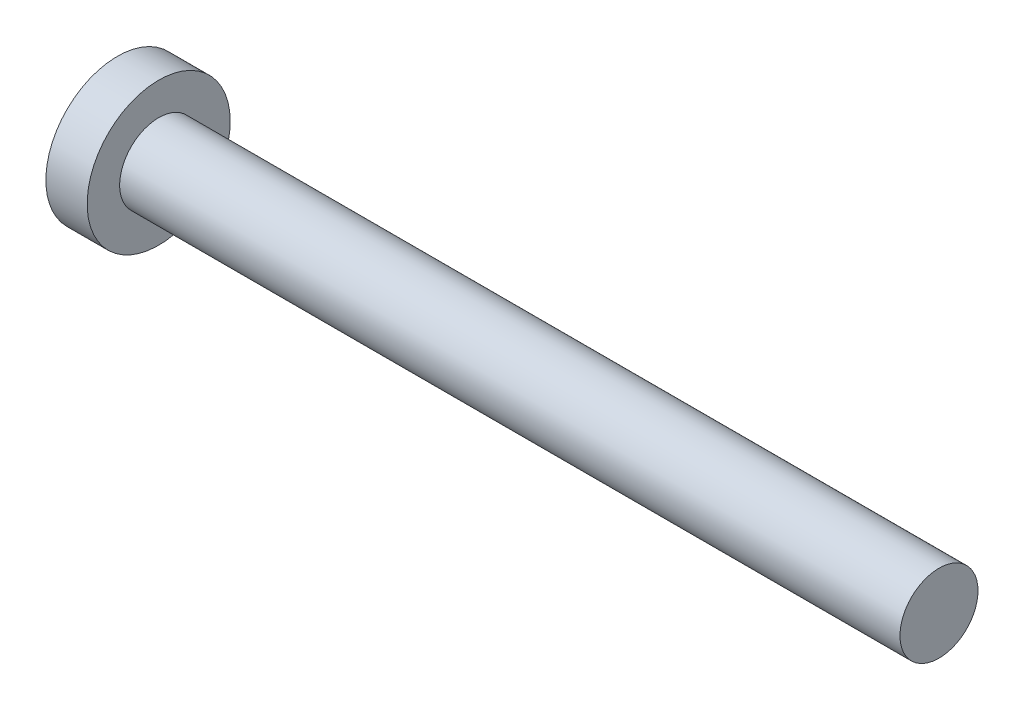
ISO-10303-21;
HEADER;
FILE_DESCRIPTION(('STEP AP214'),'2;1');
FILE_NAME('part.step','',(''),(''),'','','');
FILE_SCHEMA(('AUTOMOTIVE_DESIGN { 1 0 10303 214 1 1 1 1 }'));
ENDSEC;
DATA;
#1=APPLICATION_CONTEXT('core data for automotive mechanical design processes');
#2=APPLICATION_PROTOCOL_DEFINITION('international standard','automotive_design',2000,#1);
#3=PRODUCT_CONTEXT('',#1,'mechanical');
#4=PRODUCT('Part','Part','',(#3));
#5=PRODUCT_RELATED_PRODUCT_CATEGORY('part','',(#4));
#6=PRODUCT_DEFINITION_FORMATION('','',#4);
#7=PRODUCT_DEFINITION_CONTEXT('part definition',#1,'design');
#8=PRODUCT_DEFINITION('design','',#6,#7);
#9=PRODUCT_DEFINITION_SHAPE('','',#8);
#10=(LENGTH_UNIT() NAMED_UNIT(*) SI_UNIT(.MILLI.,.METRE.));
#11=(NAMED_UNIT(*) PLANE_ANGLE_UNIT() SI_UNIT($,.RADIAN.));
#12=(NAMED_UNIT(*) SI_UNIT($,.STERADIAN.) SOLID_ANGLE_UNIT());
#13=UNCERTAINTY_MEASURE_WITH_UNIT(LENGTH_MEASURE(1.E-05),#10,'distance_accuracy_value','');
#14=(GEOMETRIC_REPRESENTATION_CONTEXT(3) GLOBAL_UNCERTAINTY_ASSIGNED_CONTEXT((#13)) GLOBAL_UNIT_ASSIGNED_CONTEXT((#10,
#11,#12)) REPRESENTATION_CONTEXT('',''));
#15=CARTESIAN_POINT('',(0.,0.,0.));
#16=DIRECTION('',(0.,0.,1.));
#17=DIRECTION('',(1.,0.,0.));
#18=AXIS2_PLACEMENT_3D('',#15,#16,#17);
#19=CARTESIAN_POINT('',(7.,0.,0.));
#20=DIRECTION('',(1.,0.,0.));
#21=DIRECTION('',(0.,1.,0.));
#22=AXIS2_PLACEMENT_3D('',#19,#20,#21);
#23=SPHERICAL_SURFACE('',#22,7.);
#24=CARTESIAN_POINT('',(0.562803405208133,0.,0.));
#25=DIRECTION('',(1.,0.,0.));
#26=DIRECTION('',(0.,0.,-1.));
#27=AXIS2_PLACEMENT_3D('',#24,#25,#26);
#28=CIRCLE('',#27,2.75);
#29=CARTESIAN_POINT('',(0.562803405208133,0.,-2.75));
#30=VERTEX_POINT('',#29);
#31=EDGE_CURVE('E145',#30,#30,#28,.T.);
#32=ORIENTED_EDGE('',*,*,#31,.F.);
#33=EDGE_LOOP('',(#32));
#34=FACE_BOUND('',#33,.T.);
#35=CARTESIAN_POINT('',(7.,-0.35,0.));
#36=DIRECTION('',(0.,1.,0.));
#37=DIRECTION('',(0.,0.,1.));
#38=AXIS2_PLACEMENT_3D('',#35,#36,#37);
#39=CIRCLE('',#38,6.99124452440336);
#40=CARTESIAN_POINT('',(0.202207901971563,-0.35,1.63325521336445));
#41=VERTEX_POINT('',#40);
#42=CARTESIAN_POINT('',(0.0390374228846765,-0.35,0.65));
#43=VERTEX_POINT('',#42);
#44=EDGE_CURVE('E229',#41,#43,#39,.F.);
#45=ORIENTED_EDGE('',*,*,#44,.T.);
#46=CARTESIAN_POINT('',(0.0390374228846756,-0.35,0.65));
#47=CARTESIAN_POINT('',(0.0374700694243655,-0.349985440486237,0.633229435492668));
#48=CARTESIAN_POINT('',(0.0360362290844049,-0.351405486422546,0.616448534995232));
#49=CARTESIAN_POINT('',(0.0334709445420207,-0.357021752659004,0.583343325597952));
#50=CARTESIAN_POINT('',(0.0323393353853684,-0.361216454220262,0.567018772003475));
#51=CARTESIAN_POINT('',(0.0304114469291461,-0.372292892009714,0.535273514121183));
#52=CARTESIAN_POINT('',(0.0296153929596675,-0.379176427871001,0.519853423155776));
#53=CARTESIAN_POINT('',(0.0283828822273591,-0.395434490325505,0.490377163633401));
#54=CARTESIAN_POINT('',(0.027946329469038,-0.40480835105713,0.476320631858257));
#55=CARTESIAN_POINT('',(0.0274467131921521,-0.425734016368014,0.450035772000472));
#56=CARTESIAN_POINT('',(0.0273819024144786,-0.437275368321188,0.437799154967676));
#57=CARTESIAN_POINT('',(0.0276230236990662,-0.462238269102188,0.415422741964805));
#58=CARTESIAN_POINT('',(0.0279290177996376,-0.475660132220693,0.405283297198959));
#59=CARTESIAN_POINT('',(0.0289017433452393,-0.503968429911908,0.387407977842754));
#60=CARTESIAN_POINT('',(0.0295677703554314,-0.518851958231585,0.379667455933492));
#61=CARTESIAN_POINT('',(0.0312408204264315,-0.549680912740726,0.366777697245176));
#62=CARTESIAN_POINT('',(0.0322476895633196,-0.565625856989349,0.361627293376779));
#63=CARTESIAN_POINT('',(0.0342092441635674,-0.593044486650942,0.355232268632674));
#64=CARTESIAN_POINT('',(0.035082331918513,-0.604362330799613,0.35327056524664));
#65=CARTESIAN_POINT('',(0.0369623529307515,-0.627120660183501,0.350654423460588));
#66=CARTESIAN_POINT('',(0.03796909322206,-0.63856094714645,0.34999812176879));
#67=CARTESIAN_POINT('',(0.0390374228846772,-0.65,0.35));
#68=B_SPLINE_CURVE_WITH_KNOTS('',3,(#46,#47,#48,#49,#50,#51,#52,#53,#54,#55,#56,#57,#58,#59,#60,
#61,#62,#63,#64,#65,#66,#67),.UNSPECIFIED.,.F.,.F.,(4,2,2,2,2,2,2,2,2,2,4),(0.,
0.0504676812079533,0.100907761197792,0.151381658668403,0.201842074017182,0.252065120075446,
0.302296569969034,0.352430091647058,0.40254100321972,0.437028940734074,0.471467615758251),.UNSPECIFIED.);
#69=CARTESIAN_POINT('',(0.0390374228846765,-0.65,0.35));
#70=VERTEX_POINT('',#69);
#71=EDGE_CURVE('E232',#43,#70,#68,.T.);
#72=ORIENTED_EDGE('',*,*,#71,.T.);
#73=CARTESIAN_POINT('',(7.,0.,0.35));
#74=DIRECTION('',(0.,0.,-1.));
#75=DIRECTION('',(0.,1.,0.));
#76=AXIS2_PLACEMENT_3D('',#73,#74,#75);
#77=CIRCLE('',#76,6.99124452440336);
#78=CARTESIAN_POINT('',(0.202207901971563,-1.63325521336445,0.35));
#79=VERTEX_POINT('',#78);
#80=EDGE_CURVE('E241',#70,#79,#77,.F.);
#81=ORIENTED_EDGE('',*,*,#80,.T.);
#82=CARTESIAN_POINT('',(6.00777222831138,1.71858891324554,0.));
#83=DIRECTION('',(-0.500000000000001,0.866025403784438,0.));
#84=DIRECTION('',(-0.866025403784438,-0.500000000000001,0.));
#85=AXIS2_PLACEMENT_3D('',#82,#83,#84);
#86=CIRCLE('',#85,6.71281879662779);
#87=CARTESIAN_POINT('',(0.202207901971563,-1.63325521336445,-0.35));
#88=VERTEX_POINT('',#87);
#89=EDGE_CURVE('E244',#79,#88,#86,.F.);
#90=ORIENTED_EDGE('',*,*,#89,.T.);
#91=CARTESIAN_POINT('',(7.,0.,-0.35));
#92=DIRECTION('',(0.,0.,1.));
#93=DIRECTION('',(1.,0.,0.));
#94=AXIS2_PLACEMENT_3D('',#91,#92,#93);
#95=CIRCLE('',#94,6.99124452440336);
#96=CARTESIAN_POINT('',(0.0390374228846765,-0.65,-0.35));
#97=VERTEX_POINT('',#96);
#98=EDGE_CURVE('E250',#88,#97,#95,.F.);
#99=ORIENTED_EDGE('',*,*,#98,.T.);
#100=CARTESIAN_POINT('',(0.0390374228846756,-0.65,-0.35));
#101=CARTESIAN_POINT('',(0.0374700694243655,-0.633229435492668,-0.349985440486238));
#102=CARTESIAN_POINT('',(0.0360362290844049,-0.616448534995233,-0.351405486422546));
#103=CARTESIAN_POINT('',(0.0334709445420207,-0.583343325597952,-0.357021752659005));
#104=CARTESIAN_POINT('',(0.0323393353853684,-0.567018772003475,-0.361216454220263));
#105=CARTESIAN_POINT('',(0.0304114469291461,-0.535273514121184,-0.372292892009714));
#106=CARTESIAN_POINT('',(0.0296153929596675,-0.519853423155776,-0.379176427871001));
#107=CARTESIAN_POINT('',(0.0283828822273591,-0.490377163633401,-0.395434490325505));
#108=CARTESIAN_POINT('',(0.027946329469038,-0.476320631858257,-0.40480835105713));
#109=CARTESIAN_POINT('',(0.0274467131921521,-0.450035772000473,-0.425734016368015));
#110=CARTESIAN_POINT('',(0.0273819024144786,-0.437799154967677,-0.437275368321189));
#111=CARTESIAN_POINT('',(0.0276230236990662,-0.415422741964805,-0.462238269102188));
#112=CARTESIAN_POINT('',(0.0279290177996376,-0.405283297198959,-0.475660132220694));
#113=CARTESIAN_POINT('',(0.0289017433452393,-0.387407977842754,-0.503968429911908));
#114=CARTESIAN_POINT('',(0.0295677703554313,-0.379667455933492,-0.518851958231585));
#115=CARTESIAN_POINT('',(0.0312408204264315,-0.366777697245176,-0.549680912740727));
#116=CARTESIAN_POINT('',(0.0322476895633196,-0.361627293376779,-0.565625856989349));
#117=CARTESIAN_POINT('',(0.0342092441635673,-0.355232268632674,-0.593044486650942));
#118=CARTESIAN_POINT('',(0.035082331918513,-0.35327056524664,-0.604362330799613));
#119=CARTESIAN_POINT('',(0.0369623529307514,-0.350654423460588,-0.627120660183501));
#120=CARTESIAN_POINT('',(0.0379690932220599,-0.349998121768791,-0.63856094714645));
#121=CARTESIAN_POINT('',(0.0390374228846772,-0.35,-0.65));
#122=B_SPLINE_CURVE_WITH_KNOTS('',3,(#100,#101,#102,#103,#104,#105,#106,#107,#108,#109,#110,
#111,#112,#113,#114,#115,#116,#117,#118,#119,#120,#121),.UNSPECIFIED.,.F.,.F.,(4,2,2,2,2,2,2,2,
2,2,4),(0.,0.0504676812079532,0.100907761197792,0.151381658668403,0.201842074017182,
0.252065120075446,0.302296569969034,0.352430091647058,0.40254100321972,0.437028940734074,
0.471467615758251),.UNSPECIFIED.);
#123=CARTESIAN_POINT('',(0.0390374228846765,-0.35,-0.65));
#124=VERTEX_POINT('',#123);
#125=EDGE_CURVE('E351',#97,#124,#122,.T.);
#126=ORIENTED_EDGE('',*,*,#125,.T.);
#127=CARTESIAN_POINT('',(7.,-0.35,0.));
#128=DIRECTION('',(0.,1.,0.));
#129=DIRECTION('',(0.,0.,1.));
#130=AXIS2_PLACEMENT_3D('',#127,#128,#129);
#131=CIRCLE('',#130,6.99124452440336);
#132=CARTESIAN_POINT('',(0.202207901971563,-0.35,-1.63325521336445));
#133=VERTEX_POINT('',#132);
#134=EDGE_CURVE('E248',#124,#133,#131,.F.);
#135=ORIENTED_EDGE('',*,*,#134,.T.);
#136=CARTESIAN_POINT('',(6.00777222831138,0.,1.71858891324554));
#137=DIRECTION('',(-0.500000000000001,0.,0.866025403784438));
#138=DIRECTION('',(0.866025403784438,0.,0.500000000000001));
#139=AXIS2_PLACEMENT_3D('',#136,#137,#138);
#140=CIRCLE('',#139,6.71281879662779);
#141=CARTESIAN_POINT('',(0.202207901971563,0.35,-1.63325521336445));
#142=VERTEX_POINT('',#141);
#143=EDGE_CURVE('E251',#133,#142,#140,.F.);
#144=ORIENTED_EDGE('',*,*,#143,.T.);
#145=CARTESIAN_POINT('',(7.,0.35,0.));
#146=DIRECTION('',(0.,-1.,0.));
#147=DIRECTION('',(0.,0.,-1.));
#148=AXIS2_PLACEMENT_3D('',#145,#146,#147);
#149=CIRCLE('',#148,6.99124452440336);
#150=CARTESIAN_POINT('',(0.0390374228846765,0.35,-0.65));
#151=VERTEX_POINT('',#150);
#152=EDGE_CURVE('E252',#142,#151,#149,.F.);
#153=ORIENTED_EDGE('',*,*,#152,.T.);
#154=CARTESIAN_POINT('',(0.0390374228846756,0.35,-0.65));
#155=CARTESIAN_POINT('',(0.0374700694243655,0.349985440486237,-0.633229435492668));
#156=CARTESIAN_POINT('',(0.0360362290844049,0.351405486422546,-0.616448534995233));
#157=CARTESIAN_POINT('',(0.0334709445420207,0.357021752659004,-0.583343325597952));
#158=CARTESIAN_POINT('',(0.0323393353853684,0.361216454220262,-0.567018772003475));
#159=CARTESIAN_POINT('',(0.0304114469291461,0.372292892009714,-0.535273514121184));
#160=CARTESIAN_POINT('',(0.0296153929596675,0.379176427871001,-0.519853423155777));
#161=CARTESIAN_POINT('',(0.0283828822273591,0.395434490325504,-0.490377163633401));
#162=CARTESIAN_POINT('',(0.027946329469038,0.40480835105713,-0.476320631858257));
#163=CARTESIAN_POINT('',(0.0274467131921521,0.425734016368014,-0.450035772000473));
#164=CARTESIAN_POINT('',(0.0273819024144786,0.437275368321188,-0.437799154967677));
#165=CARTESIAN_POINT('',(0.0276230236990661,0.462238269102188,-0.415422741964805));
#166=CARTESIAN_POINT('',(0.0279290177996375,0.475660132220693,-0.40528329719896));
#167=CARTESIAN_POINT('',(0.0289017433452393,0.503968429911908,-0.387407977842754));
#168=CARTESIAN_POINT('',(0.0295677703554313,0.518851958231585,-0.379667455933492));
#169=CARTESIAN_POINT('',(0.0312408204264315,0.549680912740726,-0.366777697245177));
#170=CARTESIAN_POINT('',(0.0322476895633195,0.565625856989348,-0.36162729337678));
#171=CARTESIAN_POINT('',(0.0342092441635673,0.593044486650942,-0.355232268632674));
#172=CARTESIAN_POINT('',(0.0350823319185129,0.604362330799613,-0.35327056524664));
#173=CARTESIAN_POINT('',(0.0369623529307514,0.627120660183501,-0.350654423460588));
#174=CARTESIAN_POINT('',(0.0379690932220599,0.63856094714645,-0.349998121768791));
#175=CARTESIAN_POINT('',(0.0390374228846772,0.65,-0.35));
#176=B_SPLINE_CURVE_WITH_KNOTS('',3,(#154,#155,#156,#157,#158,#159,#160,#161,#162,#163,#164,
#165,#166,#167,#168,#169,#170,#171,#172,#173,#174,#175),.UNSPECIFIED.,.F.,.F.,(4,2,2,2,2,2,2,2,
2,2,4),(0.,0.0504676812079534,0.100907761197792,0.151381658668403,0.201842074017182,
0.252065120075445,0.302296569969033,0.352430091647057,0.40254100321972,0.437028940734074,
0.471467615758251),.UNSPECIFIED.);
#177=CARTESIAN_POINT('',(0.0390374228846765,0.65,-0.35));
#178=VERTEX_POINT('',#177);
#179=EDGE_CURVE('E163',#151,#178,#176,.T.);
#180=ORIENTED_EDGE('',*,*,#179,.T.);
#181=CARTESIAN_POINT('',(7.,0.,-0.35));
#182=DIRECTION('',(0.,0.,1.));
#183=DIRECTION('',(1.,0.,0.));
#184=AXIS2_PLACEMENT_3D('',#181,#182,#183);
#185=CIRCLE('',#184,6.99124452440336);
#186=CARTESIAN_POINT('',(0.202207901971563,1.63325521336445,-0.35));
#187=VERTEX_POINT('',#186);
#188=EDGE_CURVE('E254',#178,#187,#185,.F.);
#189=ORIENTED_EDGE('',*,*,#188,.T.);
#190=CARTESIAN_POINT('',(6.00777222831138,-1.71858891324554,0.));
#191=DIRECTION('',(-0.500000000000001,-0.866025403784438,0.));
#192=DIRECTION('',(0.866025403784438,-0.500000000000001,0.));
#193=AXIS2_PLACEMENT_3D('',#190,#191,#192);
#194=CIRCLE('',#193,6.71281879662779);
#195=CARTESIAN_POINT('',(0.202207901971563,1.63325521336445,0.35));
#196=VERTEX_POINT('',#195);
#197=EDGE_CURVE('E128',#187,#196,#194,.F.);
#198=ORIENTED_EDGE('',*,*,#197,.T.);
#199=CARTESIAN_POINT('',(7.,0.,0.35));
#200=DIRECTION('',(0.,0.,-1.));
#201=DIRECTION('',(0.,1.,0.));
#202=AXIS2_PLACEMENT_3D('',#199,#200,#201);
#203=CIRCLE('',#202,6.99124452440336);
#204=CARTESIAN_POINT('',(0.0390374228846765,0.65,0.35));
#205=VERTEX_POINT('',#204);
#206=EDGE_CURVE('E159',#196,#205,#203,.F.);
#207=ORIENTED_EDGE('',*,*,#206,.T.);
#208=CARTESIAN_POINT('',(0.0390374228846756,0.65,0.35));
#209=CARTESIAN_POINT('',(0.0374700694243655,0.633229435492668,0.349985440486237));
#210=CARTESIAN_POINT('',(0.0360362290844049,0.616448534995232,0.351405486422546));
#211=CARTESIAN_POINT('',(0.0334709445420207,0.583343325597952,0.357021752659004));
#212=CARTESIAN_POINT('',(0.0323393353853684,0.567018772003475,0.361216454220262));
#213=CARTESIAN_POINT('',(0.0304114469291461,0.535273514121184,0.372292892009714));
#214=CARTESIAN_POINT('',(0.0296153929596675,0.519853423155777,0.379176427871001));
#215=CARTESIAN_POINT('',(0.0283828822273591,0.490377163633401,0.395434490325504));
#216=CARTESIAN_POINT('',(0.027946329469038,0.476320631858257,0.40480835105713));
#217=CARTESIAN_POINT('',(0.0274467131921521,0.450035772000473,0.425734016368014));
#218=CARTESIAN_POINT('',(0.0273819024144786,0.437799154967677,0.437275368321188));
#219=CARTESIAN_POINT('',(0.0276230236990662,0.415422741964805,0.462238269102188));
#220=CARTESIAN_POINT('',(0.0279290177996376,0.405283297198959,0.475660132220693));
#221=CARTESIAN_POINT('',(0.0289017433452393,0.387407977842754,0.503968429911908));
#222=CARTESIAN_POINT('',(0.0295677703554313,0.379667455933492,0.518851958231585));
#223=CARTESIAN_POINT('',(0.0312408204264315,0.366777697245176,0.549680912740726));
#224=CARTESIAN_POINT('',(0.0322476895633196,0.361627293376779,0.565625856989349));
#225=CARTESIAN_POINT('',(0.0342092441635674,0.355232268632674,0.593044486650942));
#226=CARTESIAN_POINT('',(0.035082331918513,0.35327056524664,0.604362330799613));
#227=CARTESIAN_POINT('',(0.0369623529307515,0.350654423460588,0.627120660183501));
#228=CARTESIAN_POINT('',(0.03796909322206,0.34999812176879,0.63856094714645));
#229=CARTESIAN_POINT('',(0.0390374228846772,0.35,0.65));
#230=B_SPLINE_CURVE_WITH_KNOTS('',3,(#208,#209,#210,#211,#212,#213,#214,#215,#216,#217,#218,
#219,#220,#221,#222,#223,#224,#225,#226,#227,#228,#229),.UNSPECIFIED.,.F.,.F.,(4,2,2,2,2,2,2,2,
2,2,4),(0.,0.0504676812079534,0.100907761197792,0.151381658668403,0.201842074017182,
0.252065120075446,0.302296569969034,0.352430091647058,0.40254100321972,0.437028940734074,
0.471467615758251),.UNSPECIFIED.);
#231=CARTESIAN_POINT('',(0.0390374228846765,0.35,0.65));
#232=VERTEX_POINT('',#231);
#233=EDGE_CURVE('E173',#205,#232,#230,.T.);
#234=ORIENTED_EDGE('',*,*,#233,.T.);
#235=CARTESIAN_POINT('',(7.,0.35,0.));
#236=DIRECTION('',(0.,-1.,0.));
#237=DIRECTION('',(0.,0.,-1.));
#238=AXIS2_PLACEMENT_3D('',#235,#236,#237);
#239=CIRCLE('',#238,6.99124452440336);
#240=CARTESIAN_POINT('',(0.202207901971563,0.35,1.63325521336445));
#241=VERTEX_POINT('',#240);
#242=EDGE_CURVE('E164',#232,#241,#239,.F.);
#243=ORIENTED_EDGE('',*,*,#242,.T.);
#244=CARTESIAN_POINT('',(6.00777222831138,0.,-1.71858891324554));
#245=DIRECTION('',(-0.500000000000001,0.,-0.866025403784438));
#246=DIRECTION('',(-0.866025403784438,0.,0.500000000000001));
#247=AXIS2_PLACEMENT_3D('',#244,#245,#246);
#248=CIRCLE('',#247,6.71281879662779);
#249=EDGE_CURVE('E235',#241,#41,#248,.F.);
#250=ORIENTED_EDGE('',*,*,#249,.T.);
#251=EDGE_LOOP('',(#45,#72,#81,#90,#99,#126,#135,#144,#153,#180,#189,#198,#207,#234,#243,#250));
#252=FACE_BOUND('',#251,.T.);
#253=ADVANCED_FACE('F43',(#34,#252),#23,.T.);
#254=CARTESIAN_POINT('',(32.15,1.5,0.));
#255=DIRECTION('',(1.,0.,0.));
#256=DIRECTION('',(0.,0.,-1.));
#257=AXIS2_PLACEMENT_3D('',#254,#255,#256);
#258=PLANE('',#257);
#259=CARTESIAN_POINT('',(32.15,0.,0.));
#260=DIRECTION('',(1.,0.,0.));
#261=DIRECTION('',(0.,0.,-1.));
#262=AXIS2_PLACEMENT_3D('',#259,#260,#261);
#263=CIRCLE('',#262,1.5);
#264=CARTESIAN_POINT('',(32.15,0.,-1.5));
#265=VERTEX_POINT('',#264);
#266=EDGE_CURVE('E156',#265,#265,#263,.T.);
#267=ORIENTED_EDGE('',*,*,#266,.T.);
#268=EDGE_LOOP('',(#267));
#269=FACE_BOUND('',#268,.T.);
#270=ADVANCED_FACE('F215',(#269),#258,.T.);
#271=CARTESIAN_POINT('',(4.51581291088132,0.,0.));
#272=DIRECTION('',(1.,0.,0.));
#273=DIRECTION('',(0.,0.,-1.));
#274=AXIS2_PLACEMENT_3D('',#271,#272,#273);
#275=CYLINDRICAL_SURFACE('',#274,1.5);
#276=CARTESIAN_POINT('',(2.15,0.,0.));
#277=DIRECTION('',(1.,0.,0.));
#278=DIRECTION('',(0.,0.,-1.));
#279=AXIS2_PLACEMENT_3D('',#276,#277,#278);
#280=CIRCLE('',#279,1.5);
#281=CARTESIAN_POINT('',(2.15,0.,-1.5));
#282=VERTEX_POINT('',#281);
#283=EDGE_CURVE('E153',#282,#282,#280,.T.);
#284=ORIENTED_EDGE('',*,*,#283,.T.);
#285=EDGE_LOOP('',(#284));
#286=FACE_BOUND('',#285,.T.);
#287=ORIENTED_EDGE('',*,*,#266,.F.);
#288=EDGE_LOOP('',(#287));
#289=FACE_BOUND('',#288,.T.);
#290=ADVANCED_FACE('F220',(#286,#289),#275,.T.);
#291=CARTESIAN_POINT('',(2.15,1.8,0.));
#292=DIRECTION('',(1.,0.,0.));
#293=DIRECTION('',(0.,0.,-1.));
#294=AXIS2_PLACEMENT_3D('',#291,#292,#293);
#295=PLANE('',#294);
#296=CARTESIAN_POINT('',(2.15,0.,0.));
#297=DIRECTION('',(1.,0.,0.));
#298=DIRECTION('',(0.,0.,-1.));
#299=AXIS2_PLACEMENT_3D('',#296,#297,#298);
#300=CIRCLE('',#299,2.75);
#301=CARTESIAN_POINT('',(2.15,0.,-2.75));
#302=VERTEX_POINT('',#301);
#303=EDGE_CURVE('E148',#302,#302,#300,.T.);
#304=ORIENTED_EDGE('',*,*,#303,.T.);
#305=EDGE_LOOP('',(#304));
#306=FACE_BOUND('',#305,.T.);
#307=ORIENTED_EDGE('',*,*,#283,.F.);
#308=EDGE_LOOP('',(#307));
#309=FACE_BOUND('',#308,.T.);
#310=ADVANCED_FACE('F419',(#306,#309),#295,.T.);
#311=CARTESIAN_POINT('',(4.51581291088132,0.,0.));
#312=DIRECTION('',(1.,0.,0.));
#313=DIRECTION('',(0.,0.,-1.));
#314=AXIS2_PLACEMENT_3D('',#311,#312,#313);
#315=CYLINDRICAL_SURFACE('',#314,2.75);
#316=ORIENTED_EDGE('',*,*,#31,.T.);
#317=EDGE_LOOP('',(#316));
#318=FACE_BOUND('',#317,.T.);
#319=ORIENTED_EDGE('',*,*,#303,.F.);
#320=EDGE_LOOP('',(#319));
#321=FACE_BOUND('',#320,.T.);
#322=ADVANCED_FACE('F415',(#318,#321),#315,.T.);
#323=CARTESIAN_POINT('',(1.43,0.35,0.35));
#324=DIRECTION('',(0.,-1.,0.));
#325=DIRECTION('',(0.,0.,-1.));
#326=AXIS2_PLACEMENT_3D('',#323,#324,#325);
#327=PLANE('',#326);
#328=ORIENTED_EDGE('',*,*,#242,.F.);
#329=DIRECTION('',(-1.,0.,0.));
#330=VECTOR('',#329,1.);
#331=CARTESIAN_POINT('',(1.43,0.35,0.65));
#332=LINE('',#331,#330);
#333=CARTESIAN_POINT('',(1.43,0.35,0.65));
#334=VERTEX_POINT('',#333);
#335=EDGE_CURVE('E305',#232,#334,#332,.F.);
#336=ORIENTED_EDGE('',*,*,#335,.T.);
#337=DIRECTION('',(0.,0.,1.));
#338=VECTOR('',#337,1.);
#339=CARTESIAN_POINT('',(1.43,0.35,0.35));
#340=LINE('',#339,#338);
#341=CARTESIAN_POINT('',(1.43,0.35,0.924389115058833));
#342=VERTEX_POINT('',#341);
#343=EDGE_CURVE('E269',#334,#342,#340,.T.);
#344=ORIENTED_EDGE('',*,*,#343,.T.);
#345=DIRECTION('',(-0.866025403784438,0.,0.500000000000001));
#346=VECTOR('',#345,1.);
#347=CARTESIAN_POINT('',(0.,0.35,1.75));
#348=LINE('',#347,#346);
#349=EDGE_CURVE('E149',#342,#241,#348,.T.);
#350=ORIENTED_EDGE('',*,*,#349,.T.);
#351=EDGE_LOOP('',(#328,#336,#344,#350));
#352=FACE_BOUND('',#351,.T.);
#353=ADVANCED_FACE('F195',(#352),#327,.T.);
#354=CARTESIAN_POINT('',(0.,0.,1.75));
#355=DIRECTION('',(-0.500000000000001,0.,-0.866025403784438));
#356=DIRECTION('',(-0.866025403784438,0.,0.500000000000001));
#357=AXIS2_PLACEMENT_3D('',#354,#355,#356);
#358=PLANE('',#357);
#359=ORIENTED_EDGE('',*,*,#349,.F.);
#360=DIRECTION('',(0.,-1.,0.));
#361=VECTOR('',#360,1.);
#362=CARTESIAN_POINT('',(1.43,0.35,0.924389115058833));
#363=LINE('',#362,#361);
#364=CARTESIAN_POINT('',(1.43,-0.35,0.924389115058833));
#365=VERTEX_POINT('',#364);
#366=EDGE_CURVE('E266',#342,#365,#363,.T.);
#367=ORIENTED_EDGE('',*,*,#366,.T.);
#368=DIRECTION('',(-0.866025403784438,0.,0.500000000000001));
#369=VECTOR('',#368,1.);
#370=CARTESIAN_POINT('',(1.67871778264911,-0.35,0.780791836294124));
#371=LINE('',#370,#369);
#372=EDGE_CURVE('E262',#365,#41,#371,.T.);
#373=ORIENTED_EDGE('',*,*,#372,.T.);
#374=ORIENTED_EDGE('',*,*,#249,.F.);
#375=EDGE_LOOP('',(#359,#367,#373,#374));
#376=FACE_BOUND('',#375,.T.);
#377=ADVANCED_FACE('F191',(#376),#358,.T.);
#378=CARTESIAN_POINT('',(1.43,-0.35,0.35));
#379=DIRECTION('',(0.,1.,0.));
#380=DIRECTION('',(0.,0.,1.));
#381=AXIS2_PLACEMENT_3D('',#378,#379,#380);
#382=PLANE('',#381);
#383=DIRECTION('',(0.,0.,-1.));
#384=VECTOR('',#383,1.);
#385=CARTESIAN_POINT('',(1.43,-0.35,0.35));
#386=LINE('',#385,#384);
#387=CARTESIAN_POINT('',(1.43,-0.35,0.65));
#388=VERTEX_POINT('',#387);
#389=EDGE_CURVE('E268',#365,#388,#386,.T.);
#390=ORIENTED_EDGE('',*,*,#389,.T.);
#391=DIRECTION('',(-1.,0.,0.));
#392=VECTOR('',#391,1.);
#393=CARTESIAN_POINT('',(1.43,-0.35,0.65));
#394=LINE('',#393,#392);
#395=EDGE_CURVE('E160',#388,#43,#394,.T.);
#396=ORIENTED_EDGE('',*,*,#395,.T.);
#397=ORIENTED_EDGE('',*,*,#44,.F.);
#398=ORIENTED_EDGE('',*,*,#372,.F.);
#399=EDGE_LOOP('',(#390,#396,#397,#398));
#400=FACE_BOUND('',#399,.T.);
#401=ADVANCED_FACE('F194',(#400),#382,.T.);
#402=CARTESIAN_POINT('',(1.43,-0.35,0.35));
#403=DIRECTION('',(0.,0.,-1.));
#404=DIRECTION('',(0.,1.,0.));
#405=AXIS2_PLACEMENT_3D('',#402,#403,#404);
#406=PLANE('',#405);
#407=ORIENTED_EDGE('',*,*,#80,.F.);
#408=DIRECTION('',(-1.,0.,0.));
#409=VECTOR('',#408,1.);
#410=CARTESIAN_POINT('',(1.43,-0.65,0.35));
#411=LINE('',#410,#409);
#412=CARTESIAN_POINT('',(1.43,-0.65,0.35));
#413=VERTEX_POINT('',#412);
#414=EDGE_CURVE('E350',#70,#413,#411,.F.);
#415=ORIENTED_EDGE('',*,*,#414,.T.);
#416=DIRECTION('',(0.,-1.,0.));
#417=VECTOR('',#416,1.);
#418=CARTESIAN_POINT('',(1.43,-0.35,0.35));
#419=LINE('',#418,#417);
#420=CARTESIAN_POINT('',(1.43,-0.924389115058833,0.35));
#421=VERTEX_POINT('',#420);
#422=EDGE_CURVE('E289',#413,#421,#419,.T.);
#423=ORIENTED_EDGE('',*,*,#422,.T.);
#424=DIRECTION('',(-0.866025403784438,-0.500000000000001,0.));
#425=VECTOR('',#424,1.);
#426=CARTESIAN_POINT('',(0.,-1.75,0.35));
#427=LINE('',#426,#425);
#428=EDGE_CURVE('E265',#421,#79,#427,.T.);
#429=ORIENTED_EDGE('',*,*,#428,.T.);
#430=EDGE_LOOP('',(#407,#415,#423,#429));
#431=FACE_BOUND('',#430,.T.);
#432=ADVANCED_FACE('F202',(#431),#406,.T.);
#433=CARTESIAN_POINT('',(0.,-1.75,0.));
#434=DIRECTION('',(-0.500000000000001,0.866025403784438,0.));
#435=DIRECTION('',(-0.866025403784438,-0.500000000000001,0.));
#436=AXIS2_PLACEMENT_3D('',#433,#434,#435);
#437=PLANE('',#436);
#438=ORIENTED_EDGE('',*,*,#428,.F.);
#439=DIRECTION('',(0.,0.,-1.));
#440=VECTOR('',#439,1.);
#441=CARTESIAN_POINT('',(1.43,-0.924389115058833,0.35));
#442=LINE('',#441,#440);
#443=CARTESIAN_POINT('',(1.43,-0.924389115058833,-0.35));
#444=VERTEX_POINT('',#443);
#445=EDGE_CURVE('E287',#421,#444,#442,.T.);
#446=ORIENTED_EDGE('',*,*,#445,.T.);
#447=DIRECTION('',(-0.866025403784438,-0.500000000000001,0.));
#448=VECTOR('',#447,1.);
#449=CARTESIAN_POINT('',(1.67871778264911,-0.780791836294124,-0.35));
#450=LINE('',#449,#448);
#451=EDGE_CURVE('E273',#444,#88,#450,.T.);
#452=ORIENTED_EDGE('',*,*,#451,.T.);
#453=ORIENTED_EDGE('',*,*,#89,.F.);
#454=EDGE_LOOP('',(#438,#446,#452,#453));
#455=FACE_BOUND('',#454,.T.);
#456=ADVANCED_FACE('F199',(#455),#437,.T.);
#457=CARTESIAN_POINT('',(1.43,-0.35,-0.35));
#458=DIRECTION('',(0.,0.,1.));
#459=DIRECTION('',(1.,0.,0.));
#460=AXIS2_PLACEMENT_3D('',#457,#458,#459);
#461=PLANE('',#460);
#462=DIRECTION('',(0.,1.,0.));
#463=VECTOR('',#462,1.);
#464=CARTESIAN_POINT('',(1.43,-0.35,-0.35));
#465=LINE('',#464,#463);
#466=CARTESIAN_POINT('',(1.43,-0.65,-0.35));
#467=VERTEX_POINT('',#466);
#468=EDGE_CURVE('E288',#444,#467,#465,.T.);
#469=ORIENTED_EDGE('',*,*,#468,.T.);
#470=DIRECTION('',(-1.,0.,0.));
#471=VECTOR('',#470,1.);
#472=CARTESIAN_POINT('',(1.43,-0.65,-0.35));
#473=LINE('',#472,#471);
#474=EDGE_CURVE('E353',#467,#97,#473,.T.);
#475=ORIENTED_EDGE('',*,*,#474,.T.);
#476=ORIENTED_EDGE('',*,*,#98,.F.);
#477=ORIENTED_EDGE('',*,*,#451,.F.);
#478=EDGE_LOOP('',(#469,#475,#476,#477));
#479=FACE_BOUND('',#478,.T.);
#480=ADVANCED_FACE('F201',(#479),#461,.T.);
#481=CARTESIAN_POINT('',(1.43,-0.35,-0.35));
#482=DIRECTION('',(0.,1.,0.));
#483=DIRECTION('',(0.,0.,1.));
#484=AXIS2_PLACEMENT_3D('',#481,#482,#483);
#485=PLANE('',#484);
#486=ORIENTED_EDGE('',*,*,#134,.F.);
#487=DIRECTION('',(-1.,0.,0.));
#488=VECTOR('',#487,1.);
#489=CARTESIAN_POINT('',(1.43,-0.35,-0.65));
#490=LINE('',#489,#488);
#491=CARTESIAN_POINT('',(1.43,-0.35,-0.65));
#492=VERTEX_POINT('',#491);
#493=EDGE_CURVE('E378',#124,#492,#490,.F.);
#494=ORIENTED_EDGE('',*,*,#493,.T.);
#495=DIRECTION('',(0.,0.,-1.));
#496=VECTOR('',#495,1.);
#497=CARTESIAN_POINT('',(1.43,-0.35,-0.35));
#498=LINE('',#497,#496);
#499=CARTESIAN_POINT('',(1.43,-0.35,-0.924389115058833));
#500=VERTEX_POINT('',#499);
#501=EDGE_CURVE('E280',#492,#500,#498,.T.);
#502=ORIENTED_EDGE('',*,*,#501,.T.);
#503=DIRECTION('',(-0.866025403784438,0.,-0.500000000000001));
#504=VECTOR('',#503,1.);
#505=CARTESIAN_POINT('',(0.,-0.35,-1.75));
#506=LINE('',#505,#504);
#507=EDGE_CURVE('E270',#500,#133,#506,.T.);
#508=ORIENTED_EDGE('',*,*,#507,.T.);
#509=EDGE_LOOP('',(#486,#494,#502,#508));
#510=FACE_BOUND('',#509,.T.);
#511=ADVANCED_FACE('F208',(#510),#485,.T.);
#512=CARTESIAN_POINT('',(0.,0.,-1.75));
#513=DIRECTION('',(-0.500000000000001,0.,0.866025403784438));
#514=DIRECTION('',(0.866025403784438,0.,0.500000000000001));
#515=AXIS2_PLACEMENT_3D('',#512,#513,#514);
#516=PLANE('',#515);
#517=ORIENTED_EDGE('',*,*,#507,.F.);
#518=DIRECTION('',(0.,1.,0.));
#519=VECTOR('',#518,1.);
#520=CARTESIAN_POINT('',(1.43,0.35,-0.924389115058833));
#521=LINE('',#520,#519);
#522=CARTESIAN_POINT('',(1.43,0.35,-0.924389115058833));
#523=VERTEX_POINT('',#522);
#524=EDGE_CURVE('E278',#500,#523,#521,.T.);
#525=ORIENTED_EDGE('',*,*,#524,.T.);
#526=DIRECTION('',(-0.866025403784438,0.,-0.500000000000001));
#527=VECTOR('',#526,1.);
#528=CARTESIAN_POINT('',(1.67871778264911,0.35,-0.780791836294124));
#529=LINE('',#528,#527);
#530=EDGE_CURVE('E129',#523,#142,#529,.T.);
#531=ORIENTED_EDGE('',*,*,#530,.T.);
#532=ORIENTED_EDGE('',*,*,#143,.F.);
#533=EDGE_LOOP('',(#517,#525,#531,#532));
#534=FACE_BOUND('',#533,.T.);
#535=ADVANCED_FACE('F45',(#534),#516,.T.);
#536=CARTESIAN_POINT('',(1.43,0.35,-0.35));
#537=DIRECTION('',(0.,-1.,0.));
#538=DIRECTION('',(0.,0.,-1.));
#539=AXIS2_PLACEMENT_3D('',#536,#537,#538);
#540=PLANE('',#539);
#541=DIRECTION('',(0.,0.,1.));
#542=VECTOR('',#541,1.);
#543=CARTESIAN_POINT('',(1.43,0.35,-0.35));
#544=LINE('',#543,#542);
#545=CARTESIAN_POINT('',(1.43,0.35,-0.65));
#546=VERTEX_POINT('',#545);
#547=EDGE_CURVE('E123',#523,#546,#544,.T.);
#548=ORIENTED_EDGE('',*,*,#547,.T.);
#549=DIRECTION('',(-1.,0.,0.));
#550=VECTOR('',#549,1.);
#551=CARTESIAN_POINT('',(1.43,0.35,-0.65));
#552=LINE('',#551,#550);
#553=EDGE_CURVE('E300',#546,#151,#552,.T.);
#554=ORIENTED_EDGE('',*,*,#553,.T.);
#555=ORIENTED_EDGE('',*,*,#152,.F.);
#556=ORIENTED_EDGE('',*,*,#530,.F.);
#557=EDGE_LOOP('',(#548,#554,#555,#556));
#558=FACE_BOUND('',#557,.T.);
#559=ADVANCED_FACE('F392',(#558),#540,.T.);
#560=CARTESIAN_POINT('',(1.43,0.35,-0.35));
#561=DIRECTION('',(0.,0.,1.));
#562=DIRECTION('',(1.,0.,0.));
#563=AXIS2_PLACEMENT_3D('',#560,#561,#562);
#564=PLANE('',#563);
#565=ORIENTED_EDGE('',*,*,#188,.F.);
#566=DIRECTION('',(-1.,0.,0.));
#567=VECTOR('',#566,1.);
#568=CARTESIAN_POINT('',(1.43,0.65,-0.35));
#569=LINE('',#568,#567);
#570=CARTESIAN_POINT('',(1.43,0.65,-0.35));
#571=VERTEX_POINT('',#570);
#572=EDGE_CURVE('E62',#178,#571,#569,.F.);
#573=ORIENTED_EDGE('',*,*,#572,.T.);
#574=DIRECTION('',(0.,1.,0.));
#575=VECTOR('',#574,1.);
#576=CARTESIAN_POINT('',(1.43,0.35,-0.35));
#577=LINE('',#576,#575);
#578=CARTESIAN_POINT('',(1.43,0.924389115058833,-0.35));
#579=VERTEX_POINT('',#578);
#580=EDGE_CURVE('E118',#571,#579,#577,.T.);
#581=ORIENTED_EDGE('',*,*,#580,.T.);
#582=DIRECTION('',(-0.866025403784438,0.500000000000001,0.));
#583=VECTOR('',#582,1.);
#584=CARTESIAN_POINT('',(0.,1.75,-0.35));
#585=LINE('',#584,#583);
#586=EDGE_CURVE('E120',#579,#187,#585,.T.);
#587=ORIENTED_EDGE('',*,*,#586,.T.);
#588=EDGE_LOOP('',(#565,#573,#581,#587));
#589=FACE_BOUND('',#588,.T.);
#590=ADVANCED_FACE('F119',(#589),#564,.T.);
#591=CARTESIAN_POINT('',(0.,1.75,0.));
#592=DIRECTION('',(-0.500000000000001,-0.866025403784438,0.));
#593=DIRECTION('',(0.866025403784438,-0.500000000000001,0.));
#594=AXIS2_PLACEMENT_3D('',#591,#592,#593);
#595=PLANE('',#594);
#596=ORIENTED_EDGE('',*,*,#586,.F.);
#597=DIRECTION('',(0.,0.,1.));
#598=VECTOR('',#597,1.);
#599=CARTESIAN_POINT('',(1.43,0.924389115058833,0.35));
#600=LINE('',#599,#598);
#601=CARTESIAN_POINT('',(1.43,0.924389115058833,0.35));
#602=VERTEX_POINT('',#601);
#603=EDGE_CURVE('E47',#579,#602,#600,.T.);
#604=ORIENTED_EDGE('',*,*,#603,.T.);
#605=DIRECTION('',(-0.866025403784438,0.500000000000001,0.));
#606=VECTOR('',#605,1.);
#607=CARTESIAN_POINT('',(1.67871778264911,0.780791836294124,0.35));
#608=LINE('',#607,#606);
#609=EDGE_CURVE('E130',#602,#196,#608,.T.);
#610=ORIENTED_EDGE('',*,*,#609,.T.);
#611=ORIENTED_EDGE('',*,*,#197,.F.);
#612=EDGE_LOOP('',(#596,#604,#610,#611));
#613=FACE_BOUND('',#612,.T.);
#614=ADVANCED_FACE('F126',(#613),#595,.T.);
#615=CARTESIAN_POINT('',(1.43,0.35,0.35));
#616=DIRECTION('',(0.,0.,-1.));
#617=DIRECTION('',(0.,1.,0.));
#618=AXIS2_PLACEMENT_3D('',#615,#616,#617);
#619=PLANE('',#618);
#620=DIRECTION('',(0.,-1.,0.));
#621=VECTOR('',#620,1.);
#622=CARTESIAN_POINT('',(1.43,0.35,0.35));
#623=LINE('',#622,#621);
#624=CARTESIAN_POINT('',(1.43,0.65,0.35));
#625=VERTEX_POINT('',#624);
#626=EDGE_CURVE('E137',#602,#625,#623,.T.);
#627=ORIENTED_EDGE('',*,*,#626,.T.);
#628=DIRECTION('',(-1.,0.,0.));
#629=VECTOR('',#628,1.);
#630=CARTESIAN_POINT('',(1.43,0.65,0.35));
#631=LINE('',#630,#629);
#632=EDGE_CURVE('E320',#625,#205,#631,.T.);
#633=ORIENTED_EDGE('',*,*,#632,.T.);
#634=ORIENTED_EDGE('',*,*,#206,.F.);
#635=ORIENTED_EDGE('',*,*,#609,.F.);
#636=EDGE_LOOP('',(#627,#633,#634,#635));
#637=FACE_BOUND('',#636,.T.);
#638=ADVANCED_FACE('F198',(#637),#619,.T.);
#639=CARTESIAN_POINT('',(1.43,0.35,0.35));
#640=DIRECTION('',(-1.,0.,0.));
#641=DIRECTION('',(0.,0.,1.));
#642=AXIS2_PLACEMENT_3D('',#639,#640,#641);
#643=PLANE('',#642);
#644=ORIENTED_EDGE('',*,*,#343,.F.);
#645=CARTESIAN_POINT('',(1.43,0.65,0.65));
#646=DIRECTION('',(-1.,0.,0.));
#647=DIRECTION('',(0.,0.,1.));
#648=AXIS2_PLACEMENT_3D('',#645,#646,#647);
#649=CIRCLE('',#648,0.3);
#650=EDGE_CURVE('E53',#334,#625,#649,.F.);
#651=ORIENTED_EDGE('',*,*,#650,.T.);
#652=ORIENTED_EDGE('',*,*,#626,.F.);
#653=ORIENTED_EDGE('',*,*,#603,.F.);
#654=ORIENTED_EDGE('',*,*,#580,.F.);
#655=CARTESIAN_POINT('',(1.43,0.65,-0.65));
#656=DIRECTION('',(-1.,0.,0.));
#657=DIRECTION('',(0.,0.,1.));
#658=AXIS2_PLACEMENT_3D('',#655,#656,#657);
#659=CIRCLE('',#658,0.3);
#660=EDGE_CURVE('E11',#571,#546,#659,.F.);
#661=ORIENTED_EDGE('',*,*,#660,.T.);
#662=ORIENTED_EDGE('',*,*,#547,.F.);
#663=ORIENTED_EDGE('',*,*,#524,.F.);
#664=ORIENTED_EDGE('',*,*,#501,.F.);
#665=CARTESIAN_POINT('',(1.43,-0.65,-0.65));
#666=DIRECTION('',(-1.,0.,0.));
#667=DIRECTION('',(0.,0.,1.));
#668=AXIS2_PLACEMENT_3D('',#665,#666,#667);
#669=CIRCLE('',#668,0.3);
#670=EDGE_CURVE('E303',#492,#467,#669,.F.);
#671=ORIENTED_EDGE('',*,*,#670,.T.);
#672=ORIENTED_EDGE('',*,*,#468,.F.);
#673=ORIENTED_EDGE('',*,*,#445,.F.);
#674=ORIENTED_EDGE('',*,*,#422,.F.);
#675=CARTESIAN_POINT('',(1.43,-0.65,0.65));
#676=DIRECTION('',(-1.,0.,0.));
#677=DIRECTION('',(0.,0.,1.));
#678=AXIS2_PLACEMENT_3D('',#675,#676,#677);
#679=CIRCLE('',#678,0.3);
#680=EDGE_CURVE('E299',#413,#388,#679,.F.);
#681=ORIENTED_EDGE('',*,*,#680,.T.);
#682=ORIENTED_EDGE('',*,*,#389,.F.);
#683=ORIENTED_EDGE('',*,*,#366,.F.);
#684=EDGE_LOOP('',(#644,#651,#652,#653,#654,#661,#662,#663,#664,#671,#672,#673,#674,#681,#682,#683));
#685=FACE_BOUND('',#684,.T.);
#686=ADVANCED_FACE('F134',(#685),#643,.T.);
#687=CARTESIAN_POINT('',(1.43,-0.65,0.65));
#688=DIRECTION('',(-1.,0.,0.));
#689=DIRECTION('',(0.,0.,1.));
#690=AXIS2_PLACEMENT_3D('',#687,#688,#689);
#691=CYLINDRICAL_SURFACE('',#690,0.3);
#692=ORIENTED_EDGE('',*,*,#680,.F.);
#693=ORIENTED_EDGE('',*,*,#414,.F.);
#694=ORIENTED_EDGE('',*,*,#71,.F.);
#695=ORIENTED_EDGE('',*,*,#395,.F.);
#696=EDGE_LOOP('',(#692,#693,#694,#695));
#697=FACE_BOUND('',#696,.T.);
#698=ADVANCED_FACE('F349',(#697),#691,.T.);
#699=CARTESIAN_POINT('',(1.43,-0.65,-0.65));
#700=DIRECTION('',(-1.,0.,0.));
#701=DIRECTION('',(0.,0.,1.));
#702=AXIS2_PLACEMENT_3D('',#699,#700,#701);
#703=CYLINDRICAL_SURFACE('',#702,0.3);
#704=ORIENTED_EDGE('',*,*,#670,.F.);
#705=ORIENTED_EDGE('',*,*,#493,.F.);
#706=ORIENTED_EDGE('',*,*,#125,.F.);
#707=ORIENTED_EDGE('',*,*,#474,.F.);
#708=EDGE_LOOP('',(#704,#705,#706,#707));
#709=FACE_BOUND('',#708,.T.);
#710=ADVANCED_FACE('F367',(#709),#703,.T.);
#711=CARTESIAN_POINT('',(1.43,0.65,0.65));
#712=DIRECTION('',(-1.,0.,0.));
#713=DIRECTION('',(0.,0.,1.));
#714=AXIS2_PLACEMENT_3D('',#711,#712,#713);
#715=CYLINDRICAL_SURFACE('',#714,0.3);
#716=ORIENTED_EDGE('',*,*,#650,.F.);
#717=ORIENTED_EDGE('',*,*,#335,.F.);
#718=ORIENTED_EDGE('',*,*,#233,.F.);
#719=ORIENTED_EDGE('',*,*,#632,.F.);
#720=EDGE_LOOP('',(#716,#717,#718,#719));
#721=FACE_BOUND('',#720,.T.);
#722=ADVANCED_FACE('F187',(#721),#715,.T.);
#723=CARTESIAN_POINT('',(1.43,0.65,-0.65));
#724=DIRECTION('',(-1.,0.,0.));
#725=DIRECTION('',(0.,0.,1.));
#726=AXIS2_PLACEMENT_3D('',#723,#724,#725);
#727=CYLINDRICAL_SURFACE('',#726,0.3);
#728=ORIENTED_EDGE('',*,*,#660,.F.);
#729=ORIENTED_EDGE('',*,*,#572,.F.);
#730=ORIENTED_EDGE('',*,*,#179,.F.);
#731=ORIENTED_EDGE('',*,*,#553,.F.);
#732=EDGE_LOOP('',(#728,#729,#730,#731));
#733=FACE_BOUND('',#732,.T.);
#734=ADVANCED_FACE('F183',(#733),#727,.T.);
#735=CLOSED_SHELL('',(#253,#270,#290,#310,#322,#353,#377,#401,#432,#456,#480,#511,#535,#559,
#590,#614,#638,#686,#698,#710,#722,#734));
#736=MANIFOLD_SOLID_BREP('B2',#735);
#737=ADVANCED_BREP_SHAPE_REPRESENTATION('',(#18,#736),#14);
#738=SHAPE_DEFINITION_REPRESENTATION(#9,#737);
ENDSEC;
END-ISO-10303-21;
